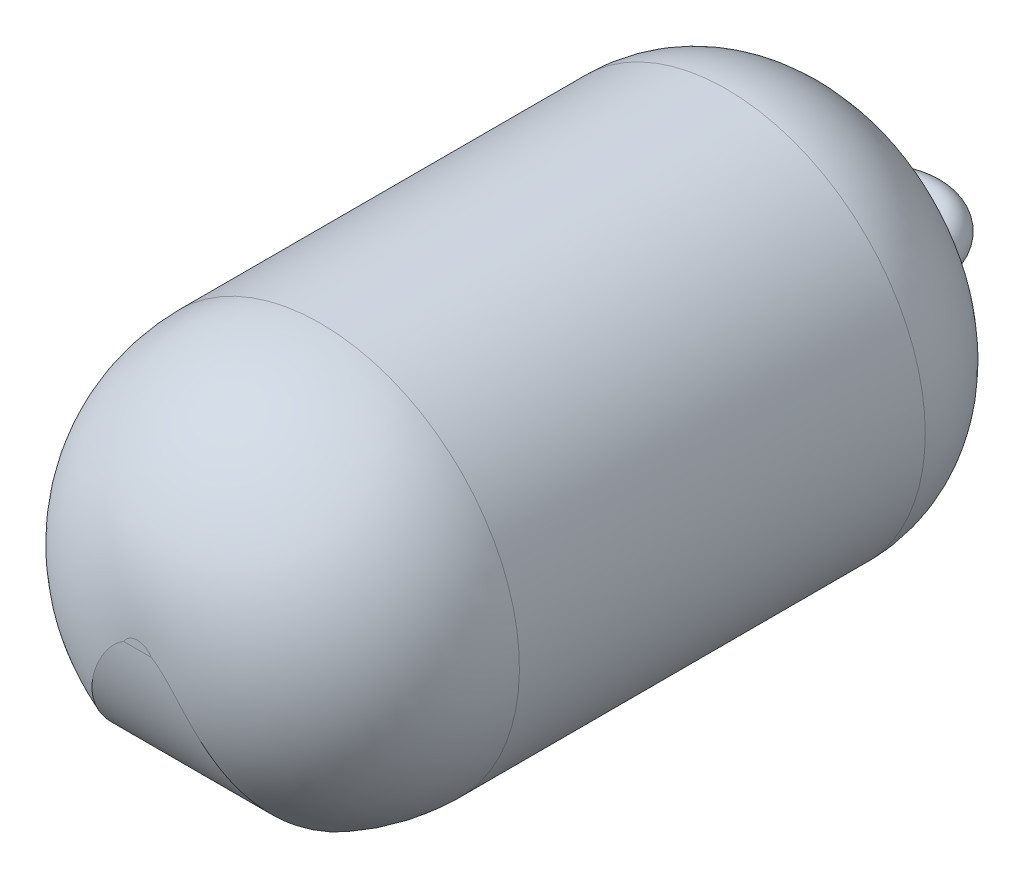
ISO-10303-21;
HEADER;
FILE_DESCRIPTION(('STEP AP214'),'2;1');
FILE_NAME('part.step','',(''),(''),'','','');
FILE_SCHEMA(('AUTOMOTIVE_DESIGN { 1 0 10303 214 1 1 1 1 }'));
ENDSEC;
DATA;
#1=APPLICATION_CONTEXT('core data for automotive mechanical design processes');
#2=APPLICATION_PROTOCOL_DEFINITION('international standard','automotive_design',2000,#1);
#3=PRODUCT_CONTEXT('',#1,'mechanical');
#4=PRODUCT('Part','Part','',(#3));
#5=PRODUCT_RELATED_PRODUCT_CATEGORY('part','',(#4));
#6=PRODUCT_DEFINITION_FORMATION('','',#4);
#7=PRODUCT_DEFINITION_CONTEXT('part definition',#1,'design');
#8=PRODUCT_DEFINITION('design','',#6,#7);
#9=PRODUCT_DEFINITION_SHAPE('','',#8);
#10=(LENGTH_UNIT() NAMED_UNIT(*) SI_UNIT(.MILLI.,.METRE.));
#11=(NAMED_UNIT(*) PLANE_ANGLE_UNIT() SI_UNIT($,.RADIAN.));
#12=(NAMED_UNIT(*) SI_UNIT($,.STERADIAN.) SOLID_ANGLE_UNIT());
#13=UNCERTAINTY_MEASURE_WITH_UNIT(LENGTH_MEASURE(1.E-05),#10,'distance_accuracy_value','');
#14=(GEOMETRIC_REPRESENTATION_CONTEXT(3) GLOBAL_UNCERTAINTY_ASSIGNED_CONTEXT((#13)) GLOBAL_UNIT_ASSIGNED_CONTEXT((#10,
#11,#12)) REPRESENTATION_CONTEXT('',''));
#15=CARTESIAN_POINT('',(0.,0.,0.));
#16=DIRECTION('',(0.,0.,1.));
#17=DIRECTION('',(1.,0.,0.));
#18=AXIS2_PLACEMENT_3D('',#15,#16,#17);
#19=CARTESIAN_POINT('',(0.,0.,0.));
#20=DIRECTION('',(0.,0.,1.));
#21=DIRECTION('',(1.,0.,0.));
#22=AXIS2_PLACEMENT_3D('',#19,#20,#21);
#23=PLANE('',#22);
#24=CARTESIAN_POINT('',(0.,0.,0.));
#25=DIRECTION('',(0.,0.,1.));
#26=DIRECTION('',(1.,0.,0.));
#27=AXIS2_PLACEMENT_3D('',#24,#25,#26);
#28=CIRCLE('',#27,9.);
#29=CARTESIAN_POINT('',(9.,0.,0.));
#30=VERTEX_POINT('',#29);
#31=EDGE_CURVE('E98',#30,#30,#28,.F.);
#32=ORIENTED_EDGE('',*,*,#31,.T.);
#33=EDGE_LOOP('',(#32));
#34=FACE_BOUND('',#33,.T.);
#35=CARTESIAN_POINT('',(6.,0.,0.));
#36=DIRECTION('',(0.,0.,-1.));
#37=DIRECTION('',(-1.,0.,0.));
#38=AXIS2_PLACEMENT_3D('',#35,#36,#37);
#39=CIRCLE('',#38,2.5);
#40=CARTESIAN_POINT('',(3.5,0.,0.));
#41=VERTEX_POINT('',#40);
#42=EDGE_CURVE('E103',#41,#41,#39,.T.);
#43=ORIENTED_EDGE('',*,*,#42,.F.);
#44=EDGE_LOOP('',(#43));
#45=FACE_BOUND('',#44,.T.);
#46=CARTESIAN_POINT('',(-6.,0.,0.));
#47=DIRECTION('',(0.,0.,1.));
#48=DIRECTION('',(1.,0.,0.));
#49=AXIS2_PLACEMENT_3D('',#46,#47,#48);
#50=CIRCLE('',#49,2.5);
#51=CARTESIAN_POINT('',(-8.5,0.,0.));
#52=VERTEX_POINT('',#51);
#53=EDGE_CURVE('E89',#52,#52,#50,.T.);
#54=ORIENTED_EDGE('',*,*,#53,.T.);
#55=EDGE_LOOP('',(#54));
#56=FACE_BOUND('',#55,.T.);
#57=ADVANCED_FACE('F41',(#34,#45,#56),#23,.F.);
#58=CARTESIAN_POINT('',(0.,0.,90.));
#59=DIRECTION('',(0.,0.,-1.));
#60=DIRECTION('',(-1.,0.,0.));
#61=AXIS2_PLACEMENT_3D('',#58,#59,#60);
#62=CYLINDRICAL_SURFACE('',#61,25.);
#63=DIRECTION('',(0.,0.,-1.));
#64=VECTOR('',#63,1.);
#65=CARTESIAN_POINT('',(-11.8743420870379,-22.,90.));
#66=LINE('',#65,#64);
#67=CARTESIAN_POINT('',(-11.8743420870379,-22.,16.));
#68=VERTEX_POINT('',#67);
#69=CARTESIAN_POINT('',(-11.8743420870379,-22.,67.));
#70=VERTEX_POINT('',#69);
#71=EDGE_CURVE('E90',#68,#70,#66,.F.);
#72=ORIENTED_EDGE('',*,*,#71,.T.);
#73=CARTESIAN_POINT('',(0.,0.,67.));
#74=DIRECTION('',(0.,0.,1.));
#75=DIRECTION('',(1.,0.,0.));
#76=AXIS2_PLACEMENT_3D('',#73,#74,#75);
#77=CIRCLE('',#76,25.);
#78=CARTESIAN_POINT('',(11.8743420870379,-22.,67.));
#79=VERTEX_POINT('',#78);
#80=EDGE_CURVE('E56',#70,#79,#77,.F.);
#81=ORIENTED_EDGE('',*,*,#80,.T.);
#82=DIRECTION('',(0.,0.,-1.));
#83=VECTOR('',#82,1.);
#84=CARTESIAN_POINT('',(11.8743420870379,-22.,90.));
#85=LINE('',#84,#83);
#86=CARTESIAN_POINT('',(11.8743420870379,-22.,16.));
#87=VERTEX_POINT('',#86);
#88=EDGE_CURVE('E83',#79,#87,#85,.T.);
#89=ORIENTED_EDGE('',*,*,#88,.T.);
#90=CARTESIAN_POINT('',(0.,0.,16.));
#91=DIRECTION('',(0.,0.,1.));
#92=DIRECTION('',(1.,0.,0.));
#93=AXIS2_PLACEMENT_3D('',#90,#91,#92);
#94=CIRCLE('',#93,25.);
#95=EDGE_CURVE('E87',#87,#68,#94,.T.);
#96=ORIENTED_EDGE('',*,*,#95,.T.);
#97=EDGE_LOOP('',(#72,#81,#89,#96));
#98=FACE_BOUND('',#97,.T.);
#99=ADVANCED_FACE('F85',(#98),#62,.T.);
#100=CARTESIAN_POINT('',(0.,0.,90.));
#101=DIRECTION('',(0.,0.,1.));
#102=DIRECTION('',(1.,0.,0.));
#103=AXIS2_PLACEMENT_3D('',#100,#101,#102);
#104=PLANE('',#103);
#105=DIRECTION('',(1.,0.,0.));
#106=VECTOR('',#105,1.);
#107=CARTESIAN_POINT('',(11.8743420870379,1.,90.));
#108=LINE('',#107,#106);
#109=CARTESIAN_POINT('',(-1.73205080756888,1.,90.));
#110=VERTEX_POINT('',#109);
#111=CARTESIAN_POINT('',(1.73205080756888,1.,90.));
#112=VERTEX_POINT('',#111);
#113=EDGE_CURVE('E97',#110,#112,#108,.T.);
#114=ORIENTED_EDGE('',*,*,#113,.T.);
#115=CARTESIAN_POINT('',(0.,0.,90.));
#116=DIRECTION('',(0.,0.,1.));
#117=DIRECTION('',(1.,0.,0.));
#118=AXIS2_PLACEMENT_3D('',#115,#116,#117);
#119=CIRCLE('',#118,2.);
#120=EDGE_CURVE('E219',#112,#110,#119,.T.);
#121=ORIENTED_EDGE('',*,*,#120,.T.);
#122=EDGE_LOOP('',(#114,#121));
#123=FACE_BOUND('',#122,.T.);
#124=ADVANCED_FACE('F129',(#123),#104,.T.);
#125=CARTESIAN_POINT('',(-6.,0.,0.));
#126=DIRECTION('',(0.,0.,-1.));
#127=DIRECTION('',(-1.,0.,0.));
#128=AXIS2_PLACEMENT_3D('',#125,#126,#127);
#129=CYLINDRICAL_SURFACE('',#128,2.5);
#130=CARTESIAN_POINT('',(-6.,0.,-3.));
#131=DIRECTION('',(0.,0.,1.));
#132=DIRECTION('',(1.,0.,0.));
#133=AXIS2_PLACEMENT_3D('',#130,#131,#132);
#134=CIRCLE('',#133,2.5);
#135=CARTESIAN_POINT('',(-8.5,0.,-3.));
#136=VERTEX_POINT('',#135);
#137=EDGE_CURVE('E232',#136,#136,#134,.T.);
#138=CARTESIAN_POINT('',(-8.5,0.,-3.));
#139=CARTESIAN_POINT('',(-8.5,0.,-2.96875));
#140=CARTESIAN_POINT('',(-8.5,0.,-2.9375));
#141=CARTESIAN_POINT('',(-8.5,0.,-2.875));
#142=CARTESIAN_POINT('',(-8.5,0.,-2.84375));
#143=CARTESIAN_POINT('',(-8.5,0.,-2.78125));
#144=CARTESIAN_POINT('',(-8.5,0.,-2.75));
#145=CARTESIAN_POINT('',(-8.5,0.,-2.6875));
#146=CARTESIAN_POINT('',(-8.5,0.,-2.65625));
#147=CARTESIAN_POINT('',(-8.5,0.,-2.59375));
#148=CARTESIAN_POINT('',(-8.5,0.,-2.5625));
#149=CARTESIAN_POINT('',(-8.5,0.,-2.5));
#150=CARTESIAN_POINT('',(-8.5,0.,-2.46875));
#151=CARTESIAN_POINT('',(-8.5,0.,-2.40625));
#152=CARTESIAN_POINT('',(-8.5,0.,-2.375));
#153=CARTESIAN_POINT('',(-8.5,0.,-2.3125));
#154=CARTESIAN_POINT('',(-8.5,0.,-2.28125));
#155=CARTESIAN_POINT('',(-8.5,0.,-2.21875));
#156=CARTESIAN_POINT('',(-8.5,0.,-2.1875));
#157=CARTESIAN_POINT('',(-8.5,0.,-2.125));
#158=CARTESIAN_POINT('',(-8.5,0.,-2.09375));
#159=CARTESIAN_POINT('',(-8.5,0.,-2.03125));
#160=CARTESIAN_POINT('',(-8.5,0.,-2.));
#161=CARTESIAN_POINT('',(-8.5,0.,-1.9375));
#162=CARTESIAN_POINT('',(-8.5,0.,-1.90625));
#163=CARTESIAN_POINT('',(-8.5,0.,-1.84375));
#164=CARTESIAN_POINT('',(-8.5,0.,-1.8125));
#165=CARTESIAN_POINT('',(-8.5,0.,-1.75));
#166=CARTESIAN_POINT('',(-8.5,0.,-1.71875));
#167=CARTESIAN_POINT('',(-8.5,0.,-1.65625));
#168=CARTESIAN_POINT('',(-8.5,0.,-1.625));
#169=CARTESIAN_POINT('',(-8.5,0.,-1.5625));
#170=CARTESIAN_POINT('',(-8.5,0.,-1.53125));
#171=CARTESIAN_POINT('',(-8.5,0.,-1.46875));
#172=CARTESIAN_POINT('',(-8.5,0.,-1.4375));
#173=CARTESIAN_POINT('',(-8.5,0.,-1.375));
#174=CARTESIAN_POINT('',(-8.5,0.,-1.34375));
#175=CARTESIAN_POINT('',(-8.5,0.,-1.28125));
#176=CARTESIAN_POINT('',(-8.5,0.,-1.25));
#177=CARTESIAN_POINT('',(-8.5,0.,-1.1875));
#178=CARTESIAN_POINT('',(-8.5,0.,-1.15625));
#179=CARTESIAN_POINT('',(-8.5,0.,-1.09375));
#180=CARTESIAN_POINT('',(-8.5,0.,-1.0625));
#181=CARTESIAN_POINT('',(-8.5,0.,-1.));
#182=CARTESIAN_POINT('',(-8.5,0.,-0.96875));
#183=CARTESIAN_POINT('',(-8.5,0.,-0.90625));
#184=CARTESIAN_POINT('',(-8.5,0.,-0.875));
#185=CARTESIAN_POINT('',(-8.5,0.,-0.8125));
#186=CARTESIAN_POINT('',(-8.5,0.,-0.78125));
#187=CARTESIAN_POINT('',(-8.5,0.,-0.71875));
#188=CARTESIAN_POINT('',(-8.5,0.,-0.6875));
#189=CARTESIAN_POINT('',(-8.5,0.,-0.625));
#190=CARTESIAN_POINT('',(-8.5,0.,-0.59375));
#191=CARTESIAN_POINT('',(-8.5,0.,-0.53125));
#192=CARTESIAN_POINT('',(-8.5,0.,-0.5));
#193=CARTESIAN_POINT('',(-8.5,0.,-0.4375));
#194=CARTESIAN_POINT('',(-8.5,0.,-0.40625));
#195=CARTESIAN_POINT('',(-8.5,0.,-0.34375));
#196=CARTESIAN_POINT('',(-8.5,0.,-0.3125));
#197=CARTESIAN_POINT('',(-8.5,0.,-0.25));
#198=CARTESIAN_POINT('',(-8.5,0.,-0.21875));
#199=CARTESIAN_POINT('',(-8.5,0.,-0.15625));
#200=CARTESIAN_POINT('',(-8.5,0.,-0.125));
#201=CARTESIAN_POINT('',(-8.5,0.,-0.0625000000000001));
#202=CARTESIAN_POINT('',(-8.5,0.,-0.03125));
#203=CARTESIAN_POINT('',(-8.5,0.,0.));
#204=B_SPLINE_CURVE_WITH_KNOTS('',3,(#138,#139,#140,#141,#142,#143,#144,#145,#146,#147,#148,
#149,#150,#151,#152,#153,#154,#155,#156,#157,#158,#159,#160,#161,#162,#163,#164,#165,#166,#167,
#168,#169,#170,#171,#172,#173,#174,#175,#176,#177,#178,#179,#180,#181,#182,#183,#184,#185,#186,
#187,#188,#189,#190,#191,#192,#193,#194,#195,#196,#197,#198,#199,#200,#201,#202,#203),
.UNSPECIFIED.,.F.,.F.,(4,2,2,2,2,2,2,2,2,2,2,2,2,2,2,2,2,2,2,2,2,2,2,2,2,2,2,2,2,2,2,2,4),(0.,
0.0937500000000001,0.1875,0.28125,0.375,0.46875,0.5625,0.65625,0.75,0.84375,0.9375,1.03125,
1.125,1.21875,1.3125,1.40625,1.5,1.59375,1.6875,1.78125,1.875,1.96875,2.0625,2.15625,2.25,
2.34375,2.4375,2.53125,2.625,2.71875,2.8125,2.90625,3.),.UNSPECIFIED.);
#205=EDGE_CURVE('BSEAM125',#136,#52,#204,.T.);
#206=ORIENTED_EDGE('',*,*,#137,.T.);
#207=ORIENTED_EDGE('',*,*,#53,.F.);
#208=ORIENTED_EDGE('',*,*,#205,.T.);
#209=ORIENTED_EDGE('',*,*,#205,.F.);
#210=EDGE_LOOP('',(#206,#208,#207,#209));
#211=FACE_BOUND('',#210,.T.);
#212=ADVANCED_FACE('F125',(#211),#129,.T.);
#213=CARTESIAN_POINT('',(0.,0.,-3.));
#214=DIRECTION('',(0.,-1.,0.));
#215=DIRECTION('',(0.,0.,-1.));
#216=AXIS2_PLACEMENT_3D('',#213,#214,#215);
#217=TOROIDAL_SURFACE('',#216,6.,2.5);
#218=CARTESIAN_POINT('',(6.,0.,-3.));
#219=DIRECTION('',(0.,0.,-1.));
#220=DIRECTION('',(-1.,0.,0.));
#221=AXIS2_PLACEMENT_3D('',#218,#219,#220);
#222=CIRCLE('',#221,2.5);
#223=CARTESIAN_POINT('',(8.5,0.,-3.));
#224=VERTEX_POINT('',#223);
#225=EDGE_CURVE('E110',#224,#224,#222,.T.);
#226=CARTESIAN_POINT('',(0.,0.,-3.));
#227=DIRECTION('',(0.,-1.,0.));
#228=DIRECTION('',(0.,0.,-1.));
#229=AXIS2_PLACEMENT_3D('',#226,#227,#228);
#230=CIRCLE('',#229,8.5);
#231=EDGE_CURVE('',#136,#224,#230,.T.);
#232=ORIENTED_EDGE('',*,*,#137,.F.);
#233=ORIENTED_EDGE('',*,*,#225,.T.);
#234=ORIENTED_EDGE('',*,*,#231,.T.);
#235=ORIENTED_EDGE('',*,*,#231,.F.);
#236=EDGE_LOOP('',(#232,#234,#233,#235));
#237=FACE_BOUND('',#236,.T.);
#238=ADVANCED_FACE('F128',(#237),#217,.T.);
#239=CARTESIAN_POINT('',(6.,0.,-3.));
#240=DIRECTION('',(0.,0.,1.));
#241=DIRECTION('',(1.,0.,0.));
#242=AXIS2_PLACEMENT_3D('',#239,#240,#241);
#243=CYLINDRICAL_SURFACE('',#242,2.5);
#244=ORIENTED_EDGE('',*,*,#42,.T.);
#245=EDGE_LOOP('',(#244));
#246=FACE_BOUND('',#245,.T.);
#247=ORIENTED_EDGE('',*,*,#225,.F.);
#248=EDGE_LOOP('',(#247));
#249=FACE_BOUND('',#248,.T.);
#250=ADVANCED_FACE('F133',(#246,#249),#243,.T.);
#251=CARTESIAN_POINT('',(0.,0.,16.));
#252=DIRECTION('',(0.,0.,1.));
#253=DIRECTION('',(1.,0.,0.));
#254=AXIS2_PLACEMENT_3D('',#251,#252,#253);
#255=DEGENERATE_TOROIDAL_SURFACE('',#254,9.,16.,.T.);
#256=CARTESIAN_POINT('',(0.,-22.,6.67262094691118));
#257=CARTESIAN_POINT('',(0.400895076638817,-22.,6.67262351358942));
#258=CARTESIAN_POINT('',(0.801799296784393,-22.,6.68788503615641));
#259=CARTESIAN_POINT('',(1.60111362399562,-22.,6.7490780904956));
#260=CARTESIAN_POINT('',(1.99952367799365,-22.,6.79501027261459));
#261=CARTESIAN_POINT('',(3.18705039927865,-22.,6.97964561558101));
#262=CARTESIAN_POINT('',(3.96992207483002,-22.,7.16518370902279));
#263=CARTESIAN_POINT('',(5.0470813399392,-22.,7.52135926333196));
#264=CARTESIAN_POINT('',(5.3601921869961,-22.,7.63765382601277));
#265=CARTESIAN_POINT('',(5.97668346989147,-22.,7.89392949013623));
#266=CARTESIAN_POINT('',(6.28006485017228,-22.,8.0339082842142));
#267=CARTESIAN_POINT('',(6.87412463347374,-22.,8.33795309550793));
#268=CARTESIAN_POINT('',(7.16481591608049,-22.,8.50199391742189));
#269=CARTESIAN_POINT('',(7.73087267211834,-22.,8.8546939847553));
#270=CARTESIAN_POINT('',(8.0062416557794,-22.,9.04334755816821));
#271=CARTESIAN_POINT('',(8.48392510125482,-22.,9.40429032373348));
#272=CARTESIAN_POINT('',(8.68967098480019,-22.,9.57204844133449));
#273=CARTESIAN_POINT('',(9.08746566571154,-22.,9.92306404197155));
#274=CARTESIAN_POINT('',(9.27951734789768,-22.,10.1063182427168));
#275=CARTESIAN_POINT('',(9.64800361621875,-22.,10.4880156912688));
#276=CARTESIAN_POINT('',(9.82443505022463,-22.,10.6864619898071));
#277=CARTESIAN_POINT('',(10.1594815813832,-22.,11.0977568989247));
#278=CARTESIAN_POINT('',(10.3181045728248,-22.,11.3105990603879));
#279=CARTESIAN_POINT('',(10.6168077324818,-22.,11.7516724784455));
#280=CARTESIAN_POINT('',(10.7567143701541,-22.,11.9800216208183));
#281=CARTESIAN_POINT('',(11.0141566573412,-22.,12.4488815264164));
#282=CARTESIAN_POINT('',(11.1317039130116,-22.,12.6893858976762));
#283=CARTESIAN_POINT('',(11.3425165159517,-22.,13.1807200690474));
#284=CARTESIAN_POINT('',(11.435791879588,-22.,13.431545560258));
#285=CARTESIAN_POINT('',(11.5964286823044,-22.,13.9413552078552));
#286=CARTESIAN_POINT('',(11.6637945385613,-22.,14.2003379653997));
#287=CARTESIAN_POINT('',(11.7639740480138,-22.,14.6880033078272));
#288=CARTESIAN_POINT('',(11.8002558987482,-22.,14.9159788566141));
#289=CARTESIAN_POINT('',(11.8520432530249,-22.,15.3742712829383));
#290=CARTESIAN_POINT('',(11.8675508048897,-22.,15.6045879273895));
#291=CARTESIAN_POINT('',(11.8775543710868,-22.,16.0655844212918));
#292=CARTESIAN_POINT('',(11.8720585514479,-22.,16.2962640947365));
#293=CARTESIAN_POINT('',(11.8401572743765,-22.,16.7561699057188));
#294=CARTESIAN_POINT('',(11.8137523001143,-22.,16.9853960767208));
#295=CARTESIAN_POINT('',(11.742996056266,-22.,17.4246309892457));
#296=CARTESIAN_POINT('',(11.7000264749055,-22.,17.6348640773264));
#297=CARTESIAN_POINT('',(11.5968723476065,-22.,18.0511297811014));
#298=CARTESIAN_POINT('',(11.536682381326,-22.,18.2571610523096));
#299=CARTESIAN_POINT('',(11.399848890031,-22.,18.6635901008419));
#300=CARTESIAN_POINT('',(11.3232113979006,-22.,18.8639899133625));
#301=CARTESIAN_POINT('',(11.1543241577095,-22.,19.2581723033243));
#302=CARTESIAN_POINT('',(11.0620684806416,-22.,19.4519523340505));
#303=CARTESIAN_POINT('',(10.8589993091627,-22.,19.8393940981112));
#304=CARTESIAN_POINT('',(10.7475947848403,-22.,20.0327461509322));
#305=CARTESIAN_POINT('',(10.5101959347562,-22.,20.4103086207997));
#306=CARTESIAN_POINT('',(10.3841964031647,-22.,20.5945157423049));
#307=CARTESIAN_POINT('',(9.9862064519685,-22.,21.1322221797279));
#308=CARTESIAN_POINT('',(9.69409724041014,-22.,21.4710460150364));
#309=CARTESIAN_POINT('',(9.02646564750397,-22.,22.1458831348834));
#310=CARTESIAN_POINT('',(8.64505551386395,-22.,22.4760182828585));
#311=CARTESIAN_POINT('',(7.84007408448968,-22.,23.0799896131361));
#312=CARTESIAN_POINT('',(7.41646716312227,-22.,23.3537776148387));
#313=CARTESIAN_POINT('',(6.32796769049101,-22.,23.9633760067281));
#314=CARTESIAN_POINT('',(5.6444629822419,-22.,24.2663563059336));
#315=CARTESIAN_POINT('',(4.59017619837988,-22.,24.6342272756252));
#316=CARTESIAN_POINT('',(4.2334799830108,-22.,24.7424925186484));
#317=CARTESIAN_POINT('',(3.51268713002689,-22.,24.9311125215903));
#318=CARTESIAN_POINT('',(3.14859112060901,-22.,25.011469640347));
#319=CARTESIAN_POINT('',(2.41042859834935,-22.,25.1458782307702));
#320=CARTESIAN_POINT('',(2.03629383613971,-22.,25.1995498816076));
#321=CARTESIAN_POINT('',(1.28497799909126,-22.,25.2795021170534));
#322=CARTESIAN_POINT('',(0.907795861717851,-22.,25.3057726920779));
#323=CARTESIAN_POINT('',(0.152247057155544,-22.,25.3311780814438));
#324=CARTESIAN_POINT('',(-0.226120267342474,-22.,25.330293345314));
#325=CARTESIAN_POINT('',(-0.981678298348034,-22.,25.3013432659262));
#326=CARTESIAN_POINT('',(-1.35886932395102,-22.,25.2732860815991));
#327=CARTESIAN_POINT('',(-2.17193237767788,-22.,25.1828104455002));
#328=CARTESIAN_POINT('',(-2.60728284773188,-22.,25.1155112509555));
#329=CARTESIAN_POINT('',(-3.47024779419366,-22.,24.9427989182171));
#330=CARTESIAN_POINT('',(-3.89786034707715,-22.,24.8373764362118));
#331=CARTESIAN_POINT('',(-5.16197625559604,-22.,24.4621141081707));
#332=CARTESIAN_POINT('',(-5.98248084106727,-22.,24.1329984314486));
#333=CARTESIAN_POINT('',(-7.27072027956629,-22.,23.446237914033));
#334=CARTESIAN_POINT('',(-7.76385083296795,-22.,23.1359629846001));
#335=CARTESIAN_POINT('',(-8.46116731439425,-22.,22.6145687489253));
#336=CARTESIAN_POINT('',(-8.68648570347406,-22.,22.4314995038246));
#337=CARTESIAN_POINT('',(-9.12074378669395,-22.,22.0467815956875));
#338=CARTESIAN_POINT('',(-9.32968500424471,-22.,21.8451346645595));
#339=CARTESIAN_POINT('',(-9.69730104847362,-22.,21.4568084518066));
#340=CARTESIAN_POINT('',(-9.85872477427798,-22.,21.2727266350911));
#341=CARTESIAN_POINT('',(-10.1663894237975,-22.,20.8922986991487));
#342=CARTESIAN_POINT('',(-10.3126331217486,-22.,20.6959548314233));
#343=CARTESIAN_POINT('',(-10.5883361077339,-22.,20.2917239880754));
#344=CARTESIAN_POINT('',(-10.7177914050992,-22.,20.083834284674));
#345=CARTESIAN_POINT('',(-10.9581950064194,-22.,19.6577259579418));
#346=CARTESIAN_POINT('',(-11.0691524035195,-22.,19.4395124776748));
#347=CARTESIAN_POINT('',(-11.271760351895,-22.,18.9925915547354));
#348=CARTESIAN_POINT('',(-11.3632829433817,-22.,18.7638259440401));
#349=CARTESIAN_POINT('',(-11.5247062364583,-22.,18.2988901968035));
#350=CARTESIAN_POINT('',(-11.5946170432567,-22.,18.0627235778822));
#351=CARTESIAN_POINT('',(-11.7117490156164,-22.,17.5848581555973));
#352=CARTESIAN_POINT('',(-11.758973901474,-22.,17.3431602661302));
#353=CARTESIAN_POINT('',(-11.8299566307801,-22.,16.8563501659709));
#354=CARTESIAN_POINT('',(-11.853716908319,-22.,16.6112383121005));
#355=CARTESIAN_POINT('',(-11.8761342581034,-22.,16.1456608570681));
#356=CARTESIAN_POINT('',(-11.8771625658783,-22.,15.9253062358478));
#357=CARTESIAN_POINT('',(-11.8600893005823,-22.,15.4852629823477));
#358=CARTESIAN_POINT('',(-11.8419816073873,-22.,15.2655745856837));
#359=CARTESIAN_POINT('',(-11.7868903960969,-22.,14.8287130184389));
#360=CARTESIAN_POINT('',(-11.7499177792039,-22.,14.6115384692558));
#361=CARTESIAN_POINT('',(-11.6575866832755,-22.,14.1810573303366));
#362=CARTESIAN_POINT('',(-11.6022212856443,-22.,13.9677522280147));
#363=CARTESIAN_POINT('',(-11.4752320694411,-22.,13.551157842324));
#364=CARTESIAN_POINT('',(-11.4039920073107,-22.,13.3477514754023));
#365=CARTESIAN_POINT('',(-11.2454616246703,-22.,12.9472657611266));
#366=CARTESIAN_POINT('',(-11.1581656850918,-22.,12.750188657273));
#367=CARTESIAN_POINT('',(-10.8736478775224,-22.,12.1702046252172));
#368=CARTESIAN_POINT('',(-10.6536930242412,-22.,11.7982129542198));
#369=CARTESIAN_POINT('',(-10.1428841355516,-22.,11.0626880725779));
#370=CARTESIAN_POINT('',(-9.84781709698805,-22.,10.7021163721931));
#371=CARTESIAN_POINT('',(-9.20875968475041,-22.,10.0271984655813));
#372=CARTESIAN_POINT('',(-8.86474082953769,-22.,9.71287938852802));
#373=CARTESIAN_POINT('',(-8.24462624782016,-22.,9.2171681508323));
#374=CARTESIAN_POINT('',(-7.97798353891728,-22.,9.02374399525922));
#375=CARTESIAN_POINT('',(-7.42880942859454,-22.,8.66089906006776));
#376=CARTESIAN_POINT('',(-7.14627311243325,-22.,8.49148576290026));
#377=CARTESIAN_POINT('',(-6.27838048535591,-22.,8.01838765740033));
#378=CARTESIAN_POINT('',(-5.67324445672941,-22.,7.75023753334579));
#379=CARTESIAN_POINT('',(-4.64860935774609,-22.,7.38277194187357));
#380=CARTESIAN_POINT('',(-4.23803588209456,-22.,7.25719465311324));
#381=CARTESIAN_POINT('',(-3.40734605905827,-22.,7.04301871664719));
#382=CARTESIAN_POINT('',(-2.98723158844532,-22.,6.9544128617406));
#383=CARTESIAN_POINT('',(-2.14067790197771,-22.,6.81304767730369));
#384=CARTESIAN_POINT('',(-1.71423296526147,-22.,6.76032307904179));
#385=CARTESIAN_POINT('',(-0.858528575401027,-22.,6.69011083494278));
#386=CARTESIAN_POINT('',(-0.429269529512914,-22.,6.67261819856922));
#387=CARTESIAN_POINT('',(0.,-22.,6.67262094691118));
#388=B_SPLINE_CURVE_WITH_KNOTS('',3,(#256,#257,#258,#259,#260,#261,#262,#263,#264,#265,#266,
#267,#268,#269,#270,#271,#272,#273,#274,#275,#276,#277,#278,#279,#280,#281,#282,#283,#284,#285,
#286,#287,#288,#289,#290,#291,#292,#293,#294,#295,#296,#297,#298,#299,#300,#301,#302,#303,#304,
#305,#306,#307,#308,#309,#310,#311,#312,#313,#314,#315,#316,#317,#318,#319,#320,#321,#322,#323,
#324,#325,#326,#327,#328,#329,#330,#331,#332,#333,#334,#335,#336,#337,#338,#339,#340,#341,#342,
#343,#344,#345,#346,#347,#348,#349,#350,#351,#352,#353,#354,#355,#356,#357,#358,#359,#360,#361,
#362,#363,#364,#365,#366,#367,#368,#369,#370,#371,#372,#373,#374,#375,#376,#377,#378,#379,#380,
#381,#382,#383,#384,#385,#386,#387),.UNSPECIFIED.,.T.,.F.,(4,2,2,2,2,2,2,2,2,2,2,2,2,2,2,2,2,2,
2,2,2,2,2,2,2,2,2,2,2,2,2,2,2,2,2,2,2,2,2,2,2,2,2,2,2,2,2,2,2,2,2,2,2,2,2,2,2,2,2,2,2,2,2,2,2,
4),(0.,1.20232716461236,2.40467982441926,4.80505189243874,5.80639307024655,6.80763675152597,
7.80783941912564,8.80781199590735,9.60348684274872,10.3989935744897,11.1946604734334,
11.9899732574981,12.792212796429,13.5940347711307,14.3955253285157,15.1968791833196,
15.8885005503797,16.580053719328,17.2713380424629,17.9626063918167,18.6056117250992,
19.2488196758391,19.891792102571,20.5350091654034,21.2037440729862,21.8727182475036,
23.2098612507394,24.7176665595526,26.2267558352667,28.456589618567,29.5740919880837,
30.691499881563,31.8243867455951,32.957687307216,34.0918038079122,35.2255798788432,
36.545300675712,37.8653451484798,40.4973331863186,42.2383725969117,43.1084047893603,
43.9783559548031,44.7121396184778,45.4457889420493,46.1796123385453,46.9130739336993,
47.6512244159355,48.3890292309118,49.1267130108886,49.8643202595371,50.5245756919911,
51.1850423529292,51.8451277909916,52.505461807303,53.1512941106463,53.7973528672074,
55.0884391505397,56.4809763735335,57.8743271520195,58.8613003560866,59.8485804553383,
61.8250339607078,63.1116490982538,64.3980133060977,65.6856208861257,66.9730460663026),.UNSPECIFIED.);
#389=EDGE_CURVE('E93',#68,#87,#388,.T.);
#390=ORIENTED_EDGE('',*,*,#389,.F.);
#391=ORIENTED_EDGE('',*,*,#95,.F.);
#392=EDGE_LOOP('',(#390,#391));
#393=FACE_BOUND('',#392,.T.);
#394=ORIENTED_EDGE('',*,*,#31,.F.);
#395=EDGE_LOOP('',(#394));
#396=FACE_BOUND('',#395,.T.);
#397=ADVANCED_FACE('F100',(#393,#396),#255,.T.);
#398=CARTESIAN_POINT('',(0.,-22.,0.));
#399=DIRECTION('',(0.,1.,0.));
#400=DIRECTION('',(0.,0.,1.));
#401=AXIS2_PLACEMENT_3D('',#398,#399,#400);
#402=PLANE('',#401);
#403=ORIENTED_EDGE('',*,*,#88,.F.);
#404=DIRECTION('',(1.,0.,0.));
#405=VECTOR('',#404,1.);
#406=CARTESIAN_POINT('',(-11.8743420870379,-22.,67.));
#407=LINE('',#406,#405);
#408=EDGE_CURVE('E11',#79,#70,#407,.F.);
#409=ORIENTED_EDGE('',*,*,#408,.T.);
#410=ORIENTED_EDGE('',*,*,#71,.F.);
#411=ORIENTED_EDGE('',*,*,#389,.T.);
#412=EDGE_LOOP('',(#403,#409,#410,#411));
#413=FACE_BOUND('',#412,.T.);
#414=ADVANCED_FACE('F94',(#413),#402,.F.);
#415=CARTESIAN_POINT('',(0.,1.,67.));
#416=DIRECTION('',(-1.,0.,0.));
#417=DIRECTION('',(0.,0.,1.));
#418=AXIS2_PLACEMENT_3D('',#415,#416,#417);
#419=CYLINDRICAL_SURFACE('',#418,23.);
#420=CARTESIAN_POINT('',(-11.8743420870379,-22.,67.));
#421=CARTESIAN_POINT('',(-11.8743412376365,-22.000000934463,67.3151734162971));
#422=CARTESIAN_POINT('',(-11.8727052864562,-21.9935208257022,67.630311371387));
#423=CARTESIAN_POINT('',(-11.8661598288958,-21.9676222546404,68.2600131372328));
#424=CARTESIAN_POINT('',(-11.8612504054391,-21.9482041200842,68.5745769623301));
#425=CARTESIAN_POINT('',(-11.8416106199314,-21.870592975072,69.5164920257841));
#426=CARTESIAN_POINT('',(-11.8219687456638,-21.7930431939192,70.1422524871343));
#427=CARTESIAN_POINT('',(-11.7695855449426,-21.5870762934084,71.384018559474));
#428=CARTESIAN_POINT('',(-11.7368598409285,-21.4587198403753,72.0000348965421));
#429=CARTESIAN_POINT('',(-11.6779239299625,-21.2289215706609,72.913863920635));
#430=CARTESIAN_POINT('',(-11.6566362143756,-21.1461069584533,73.2167878250245));
#431=CARTESIAN_POINT('',(-11.6107600397001,-20.9682037452028,73.818839936903));
#432=CARTESIAN_POINT('',(-11.5861707525169,-20.8731120650775,74.1179671714488));
#433=CARTESIAN_POINT('',(-11.5074317766805,-20.5697022516097,75.0088349500775));
#434=CARTESIAN_POINT('',(-11.4483104730494,-20.3432473810954,75.5940693697189));
#435=CARTESIAN_POINT('',(-11.3167092936877,-19.843929699024,76.7428357674843));
#436=CARTESIAN_POINT('',(-11.2442292817206,-19.571066414181,77.3063675242066));
#437=CARTESIAN_POINT('',(-11.1253892636428,-19.128787574393,78.1323647831654));
#438=CARTESIAN_POINT('',(-11.0840856355258,-18.9758507394584,78.4045009787462));
#439=CARTESIAN_POINT('',(-10.9980823929965,-18.6593279971515,78.9418607618063));
#440=CARTESIAN_POINT('',(-10.9533836538629,-18.495744836009,79.2070861074203));
#441=CARTESIAN_POINT('',(-10.8141231955112,-17.9894367344772,79.991872391567));
#442=CARTESIAN_POINT('',(-10.7143901744653,-17.6311267386233,80.5005928931658));
#443=CARTESIAN_POINT('',(-10.5000678712238,-16.8733090537831,81.4891586360935));
#444=CARTESIAN_POINT('',(-10.385372967334,-16.4735130472592,81.9687592172167));
#445=CARTESIAN_POINT('',(-10.1412560709167,-15.6383619251765,82.8918951158492));
#446=CARTESIAN_POINT('',(-10.0118339003749,-15.2030063798131,83.3354299973067));
#447=CARTESIAN_POINT('',(-9.73753833120037,-14.3001355794174,84.1839979019597));
#448=CARTESIAN_POINT('',(-9.59265501937439,-13.832599760436,84.5890059043937));
#449=CARTESIAN_POINT('',(-9.36320777180825,-13.1106378283644,85.1654850467135));
#450=CARTESIAN_POINT('',(-9.28470216004376,-12.8665323448432,85.3524783270472));
#451=CARTESIAN_POINT('',(-9.12347198914919,-12.3718739473278,85.7159613847563));
#452=CARTESIAN_POINT('',(-9.04074636845371,-12.121319418974,85.8924484948132));
#453=CARTESIAN_POINT('',(-8.78261631068357,-11.3507133626116,86.4125968668821));
#454=CARTESIAN_POINT('',(-8.60029494227784,-10.8213625638999,86.7392484001426));
#455=CARTESIAN_POINT('',(-8.2157357061211,-9.74354465181053,87.345972846029));
#456=CARTESIAN_POINT('',(-8.01349792109124,-9.19507761783655,87.6260459521014));
#457=CARTESIAN_POINT('',(-7.69341664254313,-8.362891750083,88.0102263433831));
#458=CARTESIAN_POINT('',(-7.58400001740345,-8.08407104613044,88.1322411904773));
#459=CARTESIAN_POINT('',(-7.35910668959207,-7.52396545908916,88.3643122045624));
#460=CARTESIAN_POINT('',(-7.24363132096851,-7.24268112972409,88.4743709878555));
#461=CARTESIAN_POINT('',(-7.00610698193927,-6.67857234532435,88.6824788483696));
#462=CARTESIAN_POINT('',(-6.8840601552198,-6.39574841926336,88.7805318082651));
#463=CARTESIAN_POINT('',(-6.6326866610554,-5.82945528802048,88.9646802667505));
#464=CARTESIAN_POINT('',(-6.50336031513345,-5.54598611186792,89.0507762928748));
#465=CARTESIAN_POINT('',(-6.22722990202978,-4.95966704330164,89.2166955286951));
#466=CARTESIAN_POINT('',(-6.07983610874909,-4.65684999195265,89.2956573265414));
#467=CARTESIAN_POINT('',(-5.77439580271994,-4.05338452538153,89.4401323343805));
#468=CARTESIAN_POINT('',(-5.61634972302942,-3.75273602254867,89.5056460906522));
#469=CARTESIAN_POINT('',(-5.28766751291087,-3.15539663012438,89.6235592280815));
#470=CARTESIAN_POINT('',(-5.11702033039537,-2.85870949078173,89.6759469155081));
#471=CARTESIAN_POINT('',(-4.76088191166616,-2.27236990487985,89.7679493383442));
#472=CARTESIAN_POINT('',(-4.57539516750381,-1.98271536384548,89.8075679209375));
#473=CARTESIAN_POINT('',(-4.24772911513524,-1.50425841621545,89.8640997236484));
#474=CARTESIAN_POINT('',(-4.11039381458691,-1.31251847949843,89.8842314577269));
#475=CARTESIAN_POINT('',(-3.82579531645029,-0.936073010701561,89.9191469155995));
#476=CARTESIAN_POINT('',(-3.67853510540337,-0.75136538845176,89.9339322397523));
#477=CARTESIAN_POINT('',(-3.37281906042297,-0.392100896048675,89.9585357706758));
#478=CARTESIAN_POINT('',(-3.21440197345969,-0.217512394796095,89.9683702870435));
#479=CARTESIAN_POINT('',(-2.88395436524743,0.1183499022312,89.9837081987443));
#480=CARTESIAN_POINT('',(-2.71193932642005,0.279638425385343,89.9892164439044));
#481=CARTESIAN_POINT('',(-2.41089854603537,0.533698082195565,89.9955010573535));
#482=CARTESIAN_POINT('',(-2.28623714340191,0.631612843776712,89.9972362190325));
#483=CARTESIAN_POINT('',(-2.02911875194983,0.816529122487277,89.9994533669454));
#484=CARTESIAN_POINT('',(-1.89667118022766,0.903543439959378,89.9999368364155));
#485=CARTESIAN_POINT('',(-1.75084927748257,0.989102398774512,89.999998092481));
#486=CARTESIAN_POINT('',(-1.74145948966665,0.994567850741735,90.0000000190706));
#487=CARTESIAN_POINT('',(-1.73205080756888,1.,90.));
#488=B_SPLINE_CURVE_WITH_KNOTS('',3,(#420,#421,#422,#423,#424,#425,#426,#427,#428,#429,#430,
#431,#432,#433,#434,#435,#436,#437,#438,#439,#440,#441,#442,#443,#444,#445,#446,#447,#448,#449,
#450,#451,#452,#453,#454,#455,#456,#457,#458,#459,#460,#461,#462,#463,#464,#465,#466,#467,#468,
#469,#470,#471,#472,#473,#474,#475,#476,#477,#478,#479,#480,#481,#482,#483,#484,#485,#486,#487),
.UNSPECIFIED.,.F.,.F.,(4,2,2,2,2,2,2,2,2,2,2,2,2,2,2,2,2,2,2,2,2,2,2,2,2,2,2,2,2,2,2,2,2,4),(0.,
0.945378654564582,1.89073336179665,3.7808876989597,5.66879185002562,6.61282936493426,
7.55710410557296,9.44562948648797,11.3341741282638,12.2785940176442,13.2227712512643,
15.1109570540231,17.0132773609226,18.9156206643846,20.8191911030018,21.7710397138968,
22.723128959553,24.6653071418429,26.607477257801,27.5774991759931,28.54730839839,
29.516803152126,30.4862551186114,31.5235922165829,32.5608871680698,33.5991029634913,
34.6370056634336,35.3468301376321,36.0564419614537,36.7637005356743,37.4701651242966,
37.9453269977561,38.4199255533889,38.4525190749453),.UNSPECIFIED.);
#489=EDGE_CURVE('E211',#70,#110,#488,.T.);
#490=ORIENTED_EDGE('',*,*,#489,.F.);
#491=ORIENTED_EDGE('',*,*,#408,.F.);
#492=CARTESIAN_POINT('',(11.8743420870379,-22.,67.));
#493=CARTESIAN_POINT('',(11.8743412376365,-22.000000934463,67.3151734162971));
#494=CARTESIAN_POINT('',(11.8727052864562,-21.9935208257022,67.630311371387));
#495=CARTESIAN_POINT('',(11.8661598288958,-21.9676222546404,68.2600131372328));
#496=CARTESIAN_POINT('',(11.8612504054391,-21.9482041200842,68.5745769623301));
#497=CARTESIAN_POINT('',(11.8416106199314,-21.870592975072,69.5164920257841));
#498=CARTESIAN_POINT('',(11.8219687456638,-21.7930431939192,70.1422524871343));
#499=CARTESIAN_POINT('',(11.7695855449426,-21.5870762934084,71.384018559474));
#500=CARTESIAN_POINT('',(11.7368598409285,-21.4587198403753,72.0000348965421));
#501=CARTESIAN_POINT('',(11.6779239299625,-21.2289215706609,72.913863920635));
#502=CARTESIAN_POINT('',(11.6566362143756,-21.1461069584533,73.2167878250245));
#503=CARTESIAN_POINT('',(11.6107600397001,-20.9682037452028,73.818839936903));
#504=CARTESIAN_POINT('',(11.5861707525169,-20.8731120650775,74.1179671714488));
#505=CARTESIAN_POINT('',(11.5074317766805,-20.5697022516097,75.0088349500775));
#506=CARTESIAN_POINT('',(11.4483104730494,-20.3432473810954,75.5940693697189));
#507=CARTESIAN_POINT('',(11.3167092936877,-19.843929699024,76.7428357674843));
#508=CARTESIAN_POINT('',(11.2442292817206,-19.571066414181,77.3063675242066));
#509=CARTESIAN_POINT('',(11.1253892636428,-19.128787574393,78.1323647831654));
#510=CARTESIAN_POINT('',(11.0840856355258,-18.9758507394584,78.4045009787462));
#511=CARTESIAN_POINT('',(10.9980823929965,-18.6593279971515,78.9418607618063));
#512=CARTESIAN_POINT('',(10.9533836538629,-18.495744836009,79.2070861074203));
#513=CARTESIAN_POINT('',(10.8141231955112,-17.9894367344772,79.991872391567));
#514=CARTESIAN_POINT('',(10.7143901744653,-17.6311267386233,80.5005928931658));
#515=CARTESIAN_POINT('',(10.5000678712238,-16.8733090537831,81.4891586360935));
#516=CARTESIAN_POINT('',(10.385372967334,-16.4735130472592,81.9687592172167));
#517=CARTESIAN_POINT('',(10.1412560709167,-15.6383619251765,82.8918951158492));
#518=CARTESIAN_POINT('',(10.0118339003749,-15.2030063798131,83.3354299973067));
#519=CARTESIAN_POINT('',(9.73753833120037,-14.3001355794174,84.1839979019597));
#520=CARTESIAN_POINT('',(9.59265501937439,-13.832599760436,84.5890059043937));
#521=CARTESIAN_POINT('',(9.36320777180825,-13.1106378283644,85.1654850467135));
#522=CARTESIAN_POINT('',(9.28470216004376,-12.8665323448432,85.3524783270472));
#523=CARTESIAN_POINT('',(9.12347198914919,-12.3718739473278,85.7159613847563));
#524=CARTESIAN_POINT('',(9.04074636845371,-12.121319418974,85.8924484948132));
#525=CARTESIAN_POINT('',(8.78261631068357,-11.3507133626116,86.4125968668821));
#526=CARTESIAN_POINT('',(8.60029494227784,-10.8213625638999,86.7392484001426));
#527=CARTESIAN_POINT('',(8.2157357061211,-9.74354465181053,87.345972846029));
#528=CARTESIAN_POINT('',(8.01349792109124,-9.19507761783655,87.6260459521014));
#529=CARTESIAN_POINT('',(7.69341664254313,-8.362891750083,88.0102263433831));
#530=CARTESIAN_POINT('',(7.58400001740345,-8.08407104613044,88.1322411904773));
#531=CARTESIAN_POINT('',(7.35910668959207,-7.52396545908916,88.3643122045624));
#532=CARTESIAN_POINT('',(7.24363132096851,-7.24268112972409,88.4743709878555));
#533=CARTESIAN_POINT('',(7.00610698193927,-6.67857234532435,88.6824788483696));
#534=CARTESIAN_POINT('',(6.8840601552198,-6.39574841926336,88.7805318082651));
#535=CARTESIAN_POINT('',(6.6326866610554,-5.82945528802048,88.9646802667505));
#536=CARTESIAN_POINT('',(6.50336031513345,-5.54598611186792,89.0507762928748));
#537=CARTESIAN_POINT('',(6.22722990202978,-4.95966704330164,89.2166955286951));
#538=CARTESIAN_POINT('',(6.07983610874909,-4.65684999195265,89.2956573265414));
#539=CARTESIAN_POINT('',(5.77439580271994,-4.05338452538153,89.4401323343805));
#540=CARTESIAN_POINT('',(5.61634972302942,-3.75273602254867,89.5056460906522));
#541=CARTESIAN_POINT('',(5.28766751291087,-3.15539663012438,89.6235592280815));
#542=CARTESIAN_POINT('',(5.11702033039537,-2.85870949078173,89.6759469155081));
#543=CARTESIAN_POINT('',(4.76088191166616,-2.27236990487985,89.7679493383442));
#544=CARTESIAN_POINT('',(4.57539516750381,-1.98271536384548,89.8075679209375));
#545=CARTESIAN_POINT('',(4.24772911513524,-1.50425841621545,89.8640997236484));
#546=CARTESIAN_POINT('',(4.11039381458691,-1.31251847949843,89.8842314577269));
#547=CARTESIAN_POINT('',(3.82579531645029,-0.936073010701561,89.9191469155995));
#548=CARTESIAN_POINT('',(3.67853510540337,-0.75136538845176,89.9339322397523));
#549=CARTESIAN_POINT('',(3.37281906042297,-0.392100896048675,89.9585357706758));
#550=CARTESIAN_POINT('',(3.21440197345969,-0.217512394796095,89.9683702870435));
#551=CARTESIAN_POINT('',(2.88395436524743,0.1183499022312,89.9837081987443));
#552=CARTESIAN_POINT('',(2.71193932642005,0.279638425385343,89.9892164439044));
#553=CARTESIAN_POINT('',(2.41089854603537,0.533698082195565,89.9955010573535));
#554=CARTESIAN_POINT('',(2.28623714340191,0.631612843776712,89.9972362190325));
#555=CARTESIAN_POINT('',(2.02911875194983,0.816529122487277,89.9994533669454));
#556=CARTESIAN_POINT('',(1.89667118022766,0.903543439959378,89.9999368364155));
#557=CARTESIAN_POINT('',(1.75084927748257,0.989102398774512,89.999998092481));
#558=CARTESIAN_POINT('',(1.74145948966665,0.994567850741735,90.0000000190706));
#559=CARTESIAN_POINT('',(1.73205080756888,1.,90.));
#560=B_SPLINE_CURVE_WITH_KNOTS('',3,(#492,#493,#494,#495,#496,#497,#498,#499,#500,#501,#502,
#503,#504,#505,#506,#507,#508,#509,#510,#511,#512,#513,#514,#515,#516,#517,#518,#519,#520,#521,
#522,#523,#524,#525,#526,#527,#528,#529,#530,#531,#532,#533,#534,#535,#536,#537,#538,#539,#540,
#541,#542,#543,#544,#545,#546,#547,#548,#549,#550,#551,#552,#553,#554,#555,#556,#557,#558,#559),
.UNSPECIFIED.,.F.,.F.,(4,2,2,2,2,2,2,2,2,2,2,2,2,2,2,2,2,2,2,2,2,2,2,2,2,2,2,2,2,2,2,2,2,4),(0.,
0.945378654564582,1.89073336179665,3.7808876989597,5.66879185002562,6.61282936493426,
7.55710410557296,9.44562948648797,11.3341741282638,12.2785940176442,13.2227712512643,
15.1109570540231,17.0132773609226,18.9156206643846,20.8191911030018,21.7710397138968,
22.723128959553,24.6653071418429,26.607477257801,27.5774991759931,28.54730839839,
29.516803152126,30.4862551186114,31.5235922165829,32.5608871680698,33.5991029634913,
34.6370056634336,35.3468301376321,36.0564419614537,36.7637005356743,37.4701651242966,
37.9453269977561,38.4199255533889,38.4525190749453),.UNSPECIFIED.);
#561=EDGE_CURVE('E46',#112,#79,#560,.F.);
#562=ORIENTED_EDGE('',*,*,#561,.F.);
#563=ORIENTED_EDGE('',*,*,#113,.F.);
#564=EDGE_LOOP('',(#490,#491,#562,#563));
#565=FACE_BOUND('',#564,.T.);
#566=ADVANCED_FACE('F43',(#565),#419,.T.);
#567=CARTESIAN_POINT('',(0.,0.,67.));
#568=DIRECTION('',(0.,0.,1.));
#569=DIRECTION('',(1.,0.,0.));
#570=AXIS2_PLACEMENT_3D('',#567,#568,#569);
#571=DEGENERATE_TOROIDAL_SURFACE('',#570,2.,23.,.T.);
#572=ORIENTED_EDGE('',*,*,#561,.T.);
#573=ORIENTED_EDGE('',*,*,#80,.F.);
#574=ORIENTED_EDGE('',*,*,#489,.T.);
#575=ORIENTED_EDGE('',*,*,#120,.F.);
#576=EDGE_LOOP('',(#572,#573,#574,#575));
#577=FACE_BOUND('',#576,.T.);
#578=ADVANCED_FACE('F179',(#577),#571,.T.);
#579=CLOSED_SHELL('',(#57,#99,#124,#212,#238,#250,#397,#414,#566,#578));
#580=MANIFOLD_SOLID_BREP('B2',#579);
#581=ADVANCED_BREP_SHAPE_REPRESENTATION('',(#18,#580),#14);
#582=SHAPE_DEFINITION_REPRESENTATION(#9,#581);
ENDSEC;
END-ISO-10303-21;
